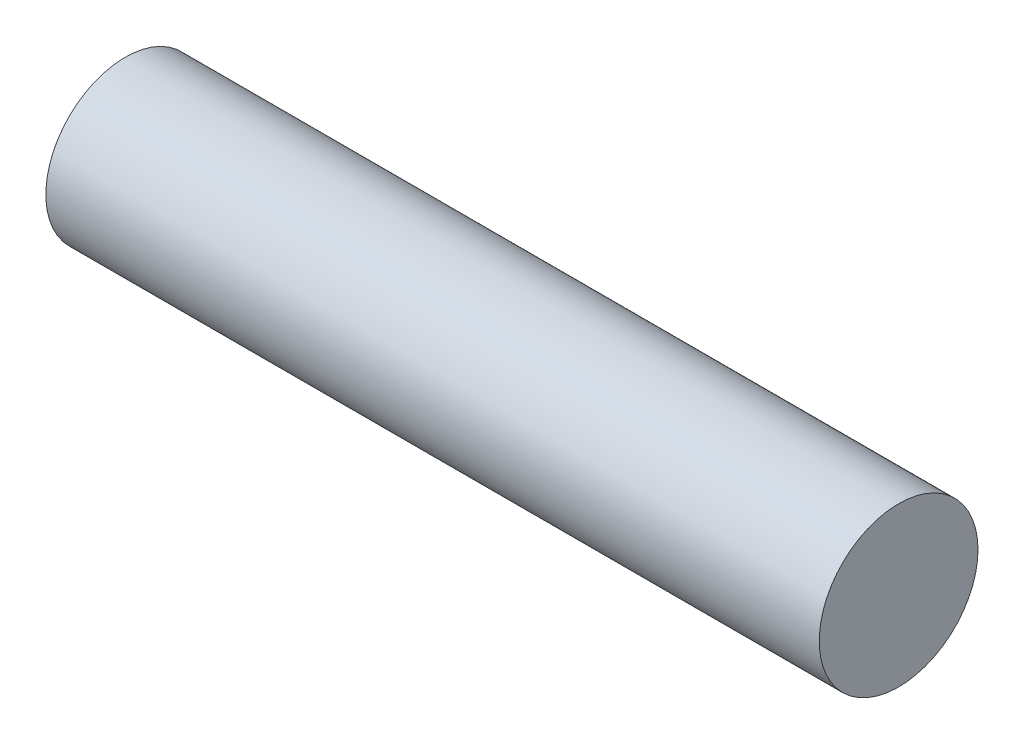
ISO-10303-21;
HEADER;
FILE_DESCRIPTION(('STEP AP214'),'2;1');
FILE_NAME('part.step','',(''),(''),'','','');
FILE_SCHEMA(('AUTOMOTIVE_DESIGN { 1 0 10303 214 1 1 1 1 }'));
ENDSEC;
DATA;
#1=APPLICATION_CONTEXT('core data for automotive mechanical design processes');
#2=APPLICATION_PROTOCOL_DEFINITION('international standard','automotive_design',2000,#1);
#3=PRODUCT_CONTEXT('',#1,'mechanical');
#4=PRODUCT('Part','Part','',(#3));
#5=PRODUCT_RELATED_PRODUCT_CATEGORY('part','',(#4));
#6=PRODUCT_DEFINITION_FORMATION('','',#4);
#7=PRODUCT_DEFINITION_CONTEXT('part definition',#1,'design');
#8=PRODUCT_DEFINITION('design','',#6,#7);
#9=PRODUCT_DEFINITION_SHAPE('','',#8);
#10=(LENGTH_UNIT() NAMED_UNIT(*) SI_UNIT(.MILLI.,.METRE.));
#11=(NAMED_UNIT(*) PLANE_ANGLE_UNIT() SI_UNIT($,.RADIAN.));
#12=(NAMED_UNIT(*) SI_UNIT($,.STERADIAN.) SOLID_ANGLE_UNIT());
#13=UNCERTAINTY_MEASURE_WITH_UNIT(LENGTH_MEASURE(1.E-05),#10,'distance_accuracy_value','');
#14=(GEOMETRIC_REPRESENTATION_CONTEXT(3) GLOBAL_UNCERTAINTY_ASSIGNED_CONTEXT((#13)) GLOBAL_UNIT_ASSIGNED_CONTEXT((#10,
#11,#12)) REPRESENTATION_CONTEXT('',''));
#15=CARTESIAN_POINT('',(0.,0.,0.));
#16=DIRECTION('',(0.,0.,1.));
#17=DIRECTION('',(1.,0.,0.));
#18=AXIS2_PLACEMENT_3D('',#15,#16,#17);
#19=CARTESIAN_POINT('',(4.826,0.,0.));
#20=DIRECTION('',(-1.,0.,0.));
#21=DIRECTION('',(0.,0.,1.));
#22=AXIS2_PLACEMENT_3D('',#19,#20,#21);
#23=CYLINDRICAL_SURFACE('',#22,0.9906);
#24=CARTESIAN_POINT('',(4.826,0.,0.));
#25=DIRECTION('',(1.,0.,0.));
#26=DIRECTION('',(0.,0.,-1.));
#27=AXIS2_PLACEMENT_3D('',#24,#25,#26);
#28=CIRCLE('',#27,0.9906);
#29=CARTESIAN_POINT('',(4.826,0.,-0.9906));
#30=VERTEX_POINT('',#29);
#31=EDGE_CURVE('E10',#30,#30,#28,.T.);
#32=ORIENTED_EDGE('',*,*,#31,.F.);
#33=EDGE_LOOP('',(#32));
#34=FACE_BOUND('',#33,.T.);
#35=CARTESIAN_POINT('',(-4.826,0.,0.));
#36=DIRECTION('',(1.,0.,0.));
#37=DIRECTION('',(0.,0.,-1.));
#38=AXIS2_PLACEMENT_3D('',#35,#36,#37);
#39=CIRCLE('',#38,0.9906);
#40=CARTESIAN_POINT('',(-4.826,0.,-0.9906));
#41=VERTEX_POINT('',#40);
#42=EDGE_CURVE('E17',#41,#41,#39,.T.);
#43=ORIENTED_EDGE('',*,*,#42,.T.);
#44=EDGE_LOOP('',(#43));
#45=FACE_BOUND('',#44,.T.);
#46=ADVANCED_FACE('F14',(#34,#45),#23,.T.);
#47=CARTESIAN_POINT('',(4.826,0.,0.));
#48=DIRECTION('',(1.,0.,0.));
#49=DIRECTION('',(0.,0.,-1.));
#50=AXIS2_PLACEMENT_3D('',#47,#48,#49);
#51=PLANE('',#50);
#52=ORIENTED_EDGE('',*,*,#31,.T.);
#53=EDGE_LOOP('',(#52));
#54=FACE_BOUND('',#53,.T.);
#55=ADVANCED_FACE('F29',(#54),#51,.T.);
#56=CARTESIAN_POINT('',(-4.826,0.,0.));
#57=DIRECTION('',(1.,0.,0.));
#58=DIRECTION('',(0.,0.,-1.));
#59=AXIS2_PLACEMENT_3D('',#56,#57,#58);
#60=PLANE('',#59);
#61=ORIENTED_EDGE('',*,*,#42,.F.);
#62=EDGE_LOOP('',(#61));
#63=FACE_BOUND('',#62,.T.);
#64=ADVANCED_FACE('F27',(#63),#60,.F.);
#65=CLOSED_SHELL('',(#46,#55,#64));
#66=MANIFOLD_SOLID_BREP('B1',#65);
#67=ADVANCED_BREP_SHAPE_REPRESENTATION('',(#18,#66),#14);
#68=SHAPE_DEFINITION_REPRESENTATION(#9,#67);
ENDSEC;
END-ISO-10303-21;
